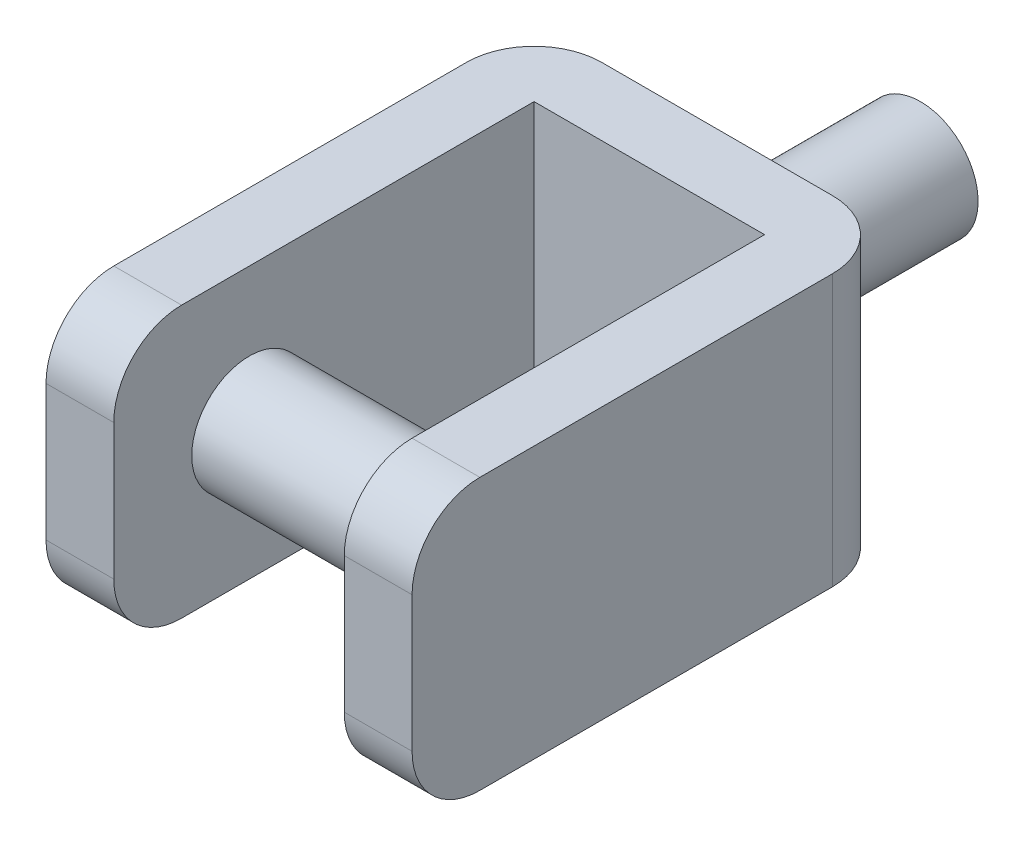
ISO-10303-21;
HEADER;
FILE_DESCRIPTION(('STEP AP214'),'2;1');
FILE_NAME('part.step','',(''),(''),'','','');
FILE_SCHEMA(('AUTOMOTIVE_DESIGN { 1 0 10303 214 1 1 1 1 }'));
ENDSEC;
DATA;
#1=APPLICATION_CONTEXT('core data for automotive mechanical design processes');
#2=APPLICATION_PROTOCOL_DEFINITION('international standard','automotive_design',2000,#1);
#3=PRODUCT_CONTEXT('',#1,'mechanical');
#4=PRODUCT('Part','Part','',(#3));
#5=PRODUCT_RELATED_PRODUCT_CATEGORY('part','',(#4));
#6=PRODUCT_DEFINITION_FORMATION('','',#4);
#7=PRODUCT_DEFINITION_CONTEXT('part definition',#1,'design');
#8=PRODUCT_DEFINITION('design','',#6,#7);
#9=PRODUCT_DEFINITION_SHAPE('','',#8);
#10=(LENGTH_UNIT() NAMED_UNIT(*) SI_UNIT(.MILLI.,.METRE.));
#11=(NAMED_UNIT(*) PLANE_ANGLE_UNIT() SI_UNIT($,.RADIAN.));
#12=(NAMED_UNIT(*) SI_UNIT($,.STERADIAN.) SOLID_ANGLE_UNIT());
#13=UNCERTAINTY_MEASURE_WITH_UNIT(LENGTH_MEASURE(1.E-05),#10,'distance_accuracy_value','');
#14=(GEOMETRIC_REPRESENTATION_CONTEXT(3) GLOBAL_UNCERTAINTY_ASSIGNED_CONTEXT((#13)) GLOBAL_UNIT_ASSIGNED_CONTEXT((#10,
#11,#12)) REPRESENTATION_CONTEXT('',''));
#15=CARTESIAN_POINT('',(0.,0.,0.));
#16=DIRECTION('',(0.,0.,1.));
#17=DIRECTION('',(1.,0.,0.));
#18=AXIS2_PLACEMENT_3D('',#15,#16,#17);
#19=CARTESIAN_POINT('',(-37.1336611930486,101.6,-124.03328));
#20=DIRECTION('',(-1.,0.,0.));
#21=DIRECTION('',(0.,0.,1.));
#22=AXIS2_PLACEMENT_3D('',#19,#20,#21);
#23=PLANE('',#22);
#24=CARTESIAN_POINT('',(-37.1336611930486,50.8,-17.35328));
#25=DIRECTION('',(-1.,0.,0.));
#26=DIRECTION('',(0.,0.,1.));
#27=AXIS2_PLACEMENT_3D('',#24,#25,#26);
#28=CIRCLE('',#27,21.59);
#29=CARTESIAN_POINT('',(-37.1336611930486,50.8,4.23672000000003));
#30=VERTEX_POINT('',#29);
#31=EDGE_CURVE('E161',#30,#30,#28,.F.);
#32=ORIENTED_EDGE('',*,*,#31,.F.);
#33=EDGE_LOOP('',(#32));
#34=FACE_BOUND('',#33,.T.);
#35=DIRECTION('',(0.,0.,-1.));
#36=VECTOR('',#35,1.);
#37=CARTESIAN_POINT('',(-37.1336611930486,101.6,-124.03328));
#38=LINE('',#37,#36);
#39=CARTESIAN_POINT('',(-37.1336611930486,101.6,8.04672000000003));
#40=VERTEX_POINT('',#39);
#41=CARTESIAN_POINT('',(-37.1336611930486,101.6,-124.03328));
#42=VERTEX_POINT('',#41);
#43=EDGE_CURVE('E134',#40,#42,#38,.T.);
#44=ORIENTED_EDGE('',*,*,#43,.F.);
#45=CARTESIAN_POINT('',(-37.1336611930486,76.2,8.04672000000004));
#46=DIRECTION('',(-1.,0.,0.));
#47=DIRECTION('',(0.,0.,1.));
#48=AXIS2_PLACEMENT_3D('',#45,#46,#47);
#49=CIRCLE('',#48,25.4);
#50=CARTESIAN_POINT('',(-37.1336611930486,76.2,33.44672));
#51=VERTEX_POINT('',#50);
#52=EDGE_CURVE('E173',#40,#51,#49,.F.);
#53=ORIENTED_EDGE('',*,*,#52,.T.);
#54=DIRECTION('',(0.,-1.,0.));
#55=VECTOR('',#54,1.);
#56=CARTESIAN_POINT('',(-37.1336611930486,101.6,33.44672));
#57=LINE('',#56,#55);
#58=CARTESIAN_POINT('',(-37.1336611930486,25.4,33.44672));
#59=VERTEX_POINT('',#58);
#60=EDGE_CURVE('E238',#51,#59,#57,.T.);
#61=ORIENTED_EDGE('',*,*,#60,.T.);
#62=CARTESIAN_POINT('',(-37.1336611930486,25.4,8.04672000000004));
#63=DIRECTION('',(-1.,0.,0.));
#64=DIRECTION('',(0.,0.,1.));
#65=AXIS2_PLACEMENT_3D('',#62,#63,#64);
#66=CIRCLE('',#65,25.4);
#67=CARTESIAN_POINT('',(-37.1336611930486,0.,8.04672000000003));
#68=VERTEX_POINT('',#67);
#69=EDGE_CURVE('E171',#59,#68,#66,.F.);
#70=ORIENTED_EDGE('',*,*,#69,.T.);
#71=DIRECTION('',(0.,0.,-1.));
#72=VECTOR('',#71,1.);
#73=CARTESIAN_POINT('',(-37.1336611930486,0.,-124.03328));
#74=LINE('',#73,#72);
#75=CARTESIAN_POINT('',(-37.1336611930486,0.,-124.03328));
#76=VERTEX_POINT('',#75);
#77=EDGE_CURVE('E156',#68,#76,#74,.T.);
#78=ORIENTED_EDGE('',*,*,#77,.T.);
#79=DIRECTION('',(0.,-1.,0.));
#80=VECTOR('',#79,1.);
#81=CARTESIAN_POINT('',(-37.1336611930486,101.6,-124.03328));
#82=LINE('',#81,#80);
#83=EDGE_CURVE('E149',#42,#76,#82,.T.);
#84=ORIENTED_EDGE('',*,*,#83,.F.);
#85=EDGE_LOOP('',(#44,#53,#61,#70,#78,#84));
#86=FACE_BOUND('',#85,.T.);
#87=ADVANCED_FACE('F33',(#34,#86),#23,.F.);
#88=CARTESIAN_POINT('',(-37.1336611930486,101.6,-124.03328));
#89=DIRECTION('',(0.,0.,-1.));
#90=DIRECTION('',(-1.,0.,0.));
#91=AXIS2_PLACEMENT_3D('',#88,#89,#90);
#92=PLANE('',#91);
#93=DIRECTION('',(1.,0.,0.));
#94=VECTOR('',#93,1.);
#95=CARTESIAN_POINT('',(-37.1336611930486,0.,-124.03328));
#96=LINE('',#95,#94);
#97=CARTESIAN_POINT('',(49.2263388069514,0.,-124.03328));
#98=VERTEX_POINT('',#97);
#99=EDGE_CURVE('E264',#76,#98,#96,.T.);
#100=ORIENTED_EDGE('',*,*,#99,.T.);
#101=DIRECTION('',(0.,-1.,0.));
#102=VECTOR('',#101,1.);
#103=CARTESIAN_POINT('',(49.2263388069514,101.6,-124.03328));
#104=LINE('',#103,#102);
#105=CARTESIAN_POINT('',(49.2263388069514,101.6,-124.03328));
#106=VERTEX_POINT('',#105);
#107=EDGE_CURVE('E151',#106,#98,#104,.T.);
#108=ORIENTED_EDGE('',*,*,#107,.F.);
#109=DIRECTION('',(1.,0.,0.));
#110=VECTOR('',#109,1.);
#111=CARTESIAN_POINT('',(-37.1336611930486,101.6,-124.03328));
#112=LINE('',#111,#110);
#113=EDGE_CURVE('E138',#42,#106,#112,.T.);
#114=ORIENTED_EDGE('',*,*,#113,.F.);
#115=ORIENTED_EDGE('',*,*,#83,.T.);
#116=EDGE_LOOP('',(#100,#108,#114,#115));
#117=FACE_BOUND('',#116,.T.);
#118=ADVANCED_FACE('F148',(#117),#92,.F.);
#119=CARTESIAN_POINT('',(49.2263388069514,101.6,-124.03328));
#120=DIRECTION('',(1.,0.,0.));
#121=DIRECTION('',(0.,0.,-1.));
#122=AXIS2_PLACEMENT_3D('',#119,#120,#121);
#123=PLANE('',#122);
#124=CARTESIAN_POINT('',(49.2263388069514,50.8,-17.35328));
#125=DIRECTION('',(1.,0.,0.));
#126=DIRECTION('',(0.,0.,-1.));
#127=AXIS2_PLACEMENT_3D('',#124,#125,#126);
#128=CIRCLE('',#127,21.59);
#129=CARTESIAN_POINT('',(49.2263388069514,50.8,-38.94328));
#130=VERTEX_POINT('',#129);
#131=EDGE_CURVE('E158',#130,#130,#128,.F.);
#132=ORIENTED_EDGE('',*,*,#131,.F.);
#133=EDGE_LOOP('',(#132));
#134=FACE_BOUND('',#133,.T.);
#135=DIRECTION('',(0.,0.,1.));
#136=VECTOR('',#135,1.);
#137=CARTESIAN_POINT('',(49.2263388069514,0.,-124.03328));
#138=LINE('',#137,#136);
#139=CARTESIAN_POINT('',(49.2263388069514,0.,8.04672000000003));
#140=VERTEX_POINT('',#139);
#141=EDGE_CURVE('E234',#98,#140,#138,.T.);
#142=ORIENTED_EDGE('',*,*,#141,.T.);
#143=CARTESIAN_POINT('',(49.2263388069514,25.4,8.04672000000004));
#144=DIRECTION('',(1.,0.,0.));
#145=DIRECTION('',(0.,0.,-1.));
#146=AXIS2_PLACEMENT_3D('',#143,#144,#145);
#147=CIRCLE('',#146,25.4);
#148=CARTESIAN_POINT('',(49.2263388069514,25.4,33.44672));
#149=VERTEX_POINT('',#148);
#150=EDGE_CURVE('E212',#140,#149,#147,.F.);
#151=ORIENTED_EDGE('',*,*,#150,.T.);
#152=DIRECTION('',(0.,-1.,0.));
#153=VECTOR('',#152,1.);
#154=CARTESIAN_POINT('',(49.2263388069514,101.6,33.44672));
#155=LINE('',#154,#153);
#156=CARTESIAN_POINT('',(49.2263388069514,76.2,33.44672));
#157=VERTEX_POINT('',#156);
#158=EDGE_CURVE('E163',#157,#149,#155,.T.);
#159=ORIENTED_EDGE('',*,*,#158,.F.);
#160=CARTESIAN_POINT('',(49.2263388069514,76.2,8.04672000000004));
#161=DIRECTION('',(1.,0.,0.));
#162=DIRECTION('',(0.,0.,-1.));
#163=AXIS2_PLACEMENT_3D('',#160,#161,#162);
#164=CIRCLE('',#163,25.4);
#165=CARTESIAN_POINT('',(49.2263388069514,101.6,8.04672000000003));
#166=VERTEX_POINT('',#165);
#167=EDGE_CURVE('E210',#157,#166,#164,.F.);
#168=ORIENTED_EDGE('',*,*,#167,.T.);
#169=DIRECTION('',(0.,0.,1.));
#170=VECTOR('',#169,1.);
#171=CARTESIAN_POINT('',(49.2263388069514,101.6,-124.03328));
#172=LINE('',#171,#170);
#173=EDGE_CURVE('E153',#106,#166,#172,.T.);
#174=ORIENTED_EDGE('',*,*,#173,.F.);
#175=ORIENTED_EDGE('',*,*,#107,.T.);
#176=EDGE_LOOP('',(#142,#151,#159,#168,#174,#175));
#177=FACE_BOUND('',#176,.T.);
#178=ADVANCED_FACE('F263',(#134,#177),#123,.F.);
#179=CARTESIAN_POINT('',(74.6263388069514,101.6,33.44672));
#180=DIRECTION('',(0.,0.,-1.));
#181=DIRECTION('',(-1.,0.,0.));
#182=AXIS2_PLACEMENT_3D('',#179,#180,#181);
#183=PLANE('',#182);
#184=ORIENTED_EDGE('',*,*,#158,.T.);
#185=DIRECTION('',(1.,0.,0.));
#186=VECTOR('',#185,1.);
#187=CARTESIAN_POINT('',(74.6263388069514,25.4,33.44672));
#188=LINE('',#187,#186);
#189=CARTESIAN_POINT('',(74.6263388069514,25.4,33.44672));
#190=VERTEX_POINT('',#189);
#191=EDGE_CURVE('E201',#149,#190,#188,.T.);
#192=ORIENTED_EDGE('',*,*,#191,.T.);
#193=DIRECTION('',(0.,-1.,0.));
#194=VECTOR('',#193,1.);
#195=CARTESIAN_POINT('',(74.6263388069514,101.6,33.44672));
#196=LINE('',#195,#194);
#197=CARTESIAN_POINT('',(74.6263388069514,76.2,33.44672));
#198=VERTEX_POINT('',#197);
#199=EDGE_CURVE('E245',#198,#190,#196,.T.);
#200=ORIENTED_EDGE('',*,*,#199,.F.);
#201=DIRECTION('',(1.,0.,0.));
#202=VECTOR('',#201,1.);
#203=CARTESIAN_POINT('',(74.6263388069514,76.2,33.44672));
#204=LINE('',#203,#202);
#205=EDGE_CURVE('E199',#198,#157,#204,.F.);
#206=ORIENTED_EDGE('',*,*,#205,.T.);
#207=EDGE_LOOP('',(#184,#192,#200,#206));
#208=FACE_BOUND('',#207,.T.);
#209=ADVANCED_FACE('F251',(#208),#183,.F.);
#210=CARTESIAN_POINT('',(74.6263388069514,101.6,-149.43328));
#211=DIRECTION('',(-1.,0.,0.));
#212=DIRECTION('',(0.,0.,1.));
#213=AXIS2_PLACEMENT_3D('',#210,#211,#212);
#214=PLANE('',#213);
#215=DIRECTION('',(0.,0.,-1.));
#216=VECTOR('',#215,1.);
#217=CARTESIAN_POINT('',(74.6263388069514,0.,-149.43328));
#218=LINE('',#217,#216);
#219=CARTESIAN_POINT('',(74.6263388069514,0.,8.04671999999998));
#220=VERTEX_POINT('',#219);
#221=CARTESIAN_POINT('',(74.6263388069514,0.,-124.03328));
#222=VERTEX_POINT('',#221);
#223=EDGE_CURVE('E231',#220,#222,#218,.T.);
#224=ORIENTED_EDGE('',*,*,#223,.T.);
#225=DIRECTION('',(0.,-1.,0.));
#226=VECTOR('',#225,1.);
#227=CARTESIAN_POINT('',(74.6263388069514,101.6,-124.03328));
#228=LINE('',#227,#226);
#229=CARTESIAN_POINT('',(74.6263388069514,101.6,-124.03328));
#230=VERTEX_POINT('',#229);
#231=EDGE_CURVE('E41',#222,#230,#228,.F.);
#232=ORIENTED_EDGE('',*,*,#231,.T.);
#233=DIRECTION('',(0.,0.,-1.));
#234=VECTOR('',#233,1.);
#235=CARTESIAN_POINT('',(74.6263388069514,101.6,-149.43328));
#236=LINE('',#235,#234);
#237=CARTESIAN_POINT('',(74.6263388069514,101.6,8.04671999999998));
#238=VERTEX_POINT('',#237);
#239=EDGE_CURVE('E271',#238,#230,#236,.T.);
#240=ORIENTED_EDGE('',*,*,#239,.F.);
#241=CARTESIAN_POINT('',(74.6263388069514,76.2,8.04672000000004));
#242=DIRECTION('',(-1.,0.,0.));
#243=DIRECTION('',(0.,0.,1.));
#244=AXIS2_PLACEMENT_3D('',#241,#242,#243);
#245=CIRCLE('',#244,25.4);
#246=EDGE_CURVE('E204',#238,#198,#245,.F.);
#247=ORIENTED_EDGE('',*,*,#246,.T.);
#248=ORIENTED_EDGE('',*,*,#199,.T.);
#249=CARTESIAN_POINT('',(74.6263388069514,25.4,8.04672000000004));
#250=DIRECTION('',(-1.,0.,0.));
#251=DIRECTION('',(0.,0.,1.));
#252=AXIS2_PLACEMENT_3D('',#249,#250,#251);
#253=CIRCLE('',#252,25.4);
#254=EDGE_CURVE('E206',#190,#220,#253,.F.);
#255=ORIENTED_EDGE('',*,*,#254,.T.);
#256=EDGE_LOOP('',(#224,#232,#240,#247,#248,#255));
#257=FACE_BOUND('',#256,.T.);
#258=ADVANCED_FACE('F260',(#257),#214,.F.);
#259=CARTESIAN_POINT('',(-62.5336611930486,101.6,-149.43328));
#260=DIRECTION('',(0.,0.,1.));
#261=DIRECTION('',(1.,0.,0.));
#262=AXIS2_PLACEMENT_3D('',#259,#260,#261);
#263=PLANE('',#262);
#264=CARTESIAN_POINT('',(6.04633880695141,50.8,-149.43328));
#265=DIRECTION('',(0.,0.,-1.));
#266=DIRECTION('',(-1.,0.,0.));
#267=AXIS2_PLACEMENT_3D('',#264,#265,#266);
#268=CIRCLE('',#267,21.59);
#269=CARTESIAN_POINT('',(-15.5436611930486,50.8,-149.43328));
#270=VERTEX_POINT('',#269);
#271=EDGE_CURVE('E169',#270,#270,#268,.T.);
#272=ORIENTED_EDGE('',*,*,#271,.F.);
#273=EDGE_LOOP('',(#272));
#274=FACE_BOUND('',#273,.T.);
#275=DIRECTION('',(-1.,0.,0.));
#276=VECTOR('',#275,1.);
#277=CARTESIAN_POINT('',(-62.5336611930486,101.6,-149.43328));
#278=LINE('',#277,#276);
#279=CARTESIAN_POINT('',(49.2263388069514,101.6,-149.43328));
#280=VERTEX_POINT('',#279);
#281=CARTESIAN_POINT('',(-37.1336611930486,101.6,-149.43328));
#282=VERTEX_POINT('',#281);
#283=EDGE_CURVE('E225',#280,#282,#278,.T.);
#284=ORIENTED_EDGE('',*,*,#283,.F.);
#285=DIRECTION('',(0.,-1.,0.));
#286=VECTOR('',#285,1.);
#287=CARTESIAN_POINT('',(49.2263388069514,101.6,-149.43328));
#288=LINE('',#287,#286);
#289=CARTESIAN_POINT('',(49.2263388069514,0.,-149.43328));
#290=VERTEX_POINT('',#289);
#291=EDGE_CURVE('E217',#280,#290,#288,.T.);
#292=ORIENTED_EDGE('',*,*,#291,.T.);
#293=DIRECTION('',(-1.,0.,0.));
#294=VECTOR('',#293,1.);
#295=CARTESIAN_POINT('',(-62.5336611930486,0.,-149.43328));
#296=LINE('',#295,#294);
#297=CARTESIAN_POINT('',(-37.1336611930486,0.,-149.43328));
#298=VERTEX_POINT('',#297);
#299=EDGE_CURVE('E224',#290,#298,#296,.T.);
#300=ORIENTED_EDGE('',*,*,#299,.T.);
#301=DIRECTION('',(0.,-1.,0.));
#302=VECTOR('',#301,1.);
#303=CARTESIAN_POINT('',(-37.1336611930486,101.6,-149.43328));
#304=LINE('',#303,#302);
#305=EDGE_CURVE('E194',#298,#282,#304,.F.);
#306=ORIENTED_EDGE('',*,*,#305,.T.);
#307=EDGE_LOOP('',(#284,#292,#300,#306));
#308=FACE_BOUND('',#307,.T.);
#309=ADVANCED_FACE('F223',(#274,#308),#263,.F.);
#310=CARTESIAN_POINT('',(-62.5336611930486,101.6,33.44672));
#311=DIRECTION('',(1.,0.,0.));
#312=DIRECTION('',(0.,0.,-1.));
#313=AXIS2_PLACEMENT_3D('',#310,#311,#312);
#314=PLANE('',#313);
#315=DIRECTION('',(0.,0.,1.));
#316=VECTOR('',#315,1.);
#317=CARTESIAN_POINT('',(-62.5336611930486,101.6,33.44672));
#318=LINE('',#317,#316);
#319=CARTESIAN_POINT('',(-62.5336611930486,101.6,-124.03328));
#320=VERTEX_POINT('',#319);
#321=CARTESIAN_POINT('',(-62.5336611930486,101.6,8.04672000000005));
#322=VERTEX_POINT('',#321);
#323=EDGE_CURVE('E242',#320,#322,#318,.T.);
#324=ORIENTED_EDGE('',*,*,#323,.F.);
#325=DIRECTION('',(0.,-1.,0.));
#326=VECTOR('',#325,1.);
#327=CARTESIAN_POINT('',(-62.5336611930486,101.6,-124.03328));
#328=LINE('',#327,#326);
#329=CARTESIAN_POINT('',(-62.5336611930486,0.,-124.03328));
#330=VERTEX_POINT('',#329);
#331=EDGE_CURVE('E188',#320,#330,#328,.T.);
#332=ORIENTED_EDGE('',*,*,#331,.T.);
#333=DIRECTION('',(0.,0.,1.));
#334=VECTOR('',#333,1.);
#335=CARTESIAN_POINT('',(-62.5336611930486,0.,33.44672));
#336=LINE('',#335,#334);
#337=CARTESIAN_POINT('',(-62.5336611930486,0.,8.04672000000005));
#338=VERTEX_POINT('',#337);
#339=EDGE_CURVE('E144',#330,#338,#336,.T.);
#340=ORIENTED_EDGE('',*,*,#339,.T.);
#341=CARTESIAN_POINT('',(-62.5336611930486,25.4,8.04672000000004));
#342=DIRECTION('',(1.,0.,0.));
#343=DIRECTION('',(0.,0.,-1.));
#344=AXIS2_PLACEMENT_3D('',#341,#342,#343);
#345=CIRCLE('',#344,25.4);
#346=CARTESIAN_POINT('',(-62.5336611930486,25.4,33.44672));
#347=VERTEX_POINT('',#346);
#348=EDGE_CURVE('E180',#338,#347,#345,.F.);
#349=ORIENTED_EDGE('',*,*,#348,.T.);
#350=DIRECTION('',(0.,-1.,0.));
#351=VECTOR('',#350,1.);
#352=CARTESIAN_POINT('',(-62.5336611930486,101.6,33.44672));
#353=LINE('',#352,#351);
#354=CARTESIAN_POINT('',(-62.5336611930486,76.2,33.44672));
#355=VERTEX_POINT('',#354);
#356=EDGE_CURVE('E241',#355,#347,#353,.T.);
#357=ORIENTED_EDGE('',*,*,#356,.F.);
#358=CARTESIAN_POINT('',(-62.5336611930486,76.2,8.04672000000004));
#359=DIRECTION('',(1.,0.,0.));
#360=DIRECTION('',(0.,0.,-1.));
#361=AXIS2_PLACEMENT_3D('',#358,#359,#360);
#362=CIRCLE('',#361,25.4);
#363=EDGE_CURVE('E182',#355,#322,#362,.F.);
#364=ORIENTED_EDGE('',*,*,#363,.T.);
#365=EDGE_LOOP('',(#324,#332,#340,#349,#357,#364));
#366=FACE_BOUND('',#365,.T.);
#367=ADVANCED_FACE('F289',(#366),#314,.F.);
#368=CARTESIAN_POINT('',(-37.1336611930486,101.6,33.44672));
#369=DIRECTION('',(0.,0.,-1.));
#370=DIRECTION('',(-1.,0.,0.));
#371=AXIS2_PLACEMENT_3D('',#368,#369,#370);
#372=PLANE('',#371);
#373=ORIENTED_EDGE('',*,*,#60,.F.);
#374=DIRECTION('',(1.,0.,0.));
#375=VECTOR('',#374,1.);
#376=CARTESIAN_POINT('',(-37.1336611930486,76.2,33.44672));
#377=LINE('',#376,#375);
#378=EDGE_CURVE('E178',#51,#355,#377,.F.);
#379=ORIENTED_EDGE('',*,*,#378,.T.);
#380=ORIENTED_EDGE('',*,*,#356,.T.);
#381=DIRECTION('',(1.,0.,0.));
#382=VECTOR('',#381,1.);
#383=CARTESIAN_POINT('',(-37.1336611930486,25.4,33.44672));
#384=LINE('',#383,#382);
#385=EDGE_CURVE('E175',#347,#59,#384,.T.);
#386=ORIENTED_EDGE('',*,*,#385,.T.);
#387=EDGE_LOOP('',(#373,#379,#380,#386));
#388=FACE_BOUND('',#387,.T.);
#389=ADVANCED_FACE('F296',(#388),#372,.F.);
#390=CARTESIAN_POINT('',(0.,101.6,0.));
#391=DIRECTION('',(0.,-1.,0.));
#392=DIRECTION('',(0.,0.,-1.));
#393=AXIS2_PLACEMENT_3D('',#390,#391,#392);
#394=PLANE('',#393);
#395=ORIENTED_EDGE('',*,*,#239,.T.);
#396=CARTESIAN_POINT('',(49.2263388069514,101.6,-124.03328));
#397=DIRECTION('',(0.,-1.,0.));
#398=DIRECTION('',(0.,0.,-1.));
#399=AXIS2_PLACEMENT_3D('',#396,#397,#398);
#400=CIRCLE('',#399,25.4);
#401=EDGE_CURVE('E11',#230,#280,#400,.F.);
#402=ORIENTED_EDGE('',*,*,#401,.T.);
#403=ORIENTED_EDGE('',*,*,#283,.T.);
#404=CARTESIAN_POINT('',(-37.1336611930486,101.6,-124.03328));
#405=DIRECTION('',(0.,-1.,0.));
#406=DIRECTION('',(0.,0.,-1.));
#407=AXIS2_PLACEMENT_3D('',#404,#405,#406);
#408=CIRCLE('',#407,25.4);
#409=EDGE_CURVE('E197',#282,#320,#408,.F.);
#410=ORIENTED_EDGE('',*,*,#409,.T.);
#411=ORIENTED_EDGE('',*,*,#323,.T.);
#412=DIRECTION('',(1.,0.,0.));
#413=VECTOR('',#412,1.);
#414=CARTESIAN_POINT('',(0.,101.6,8.04672000000004));
#415=LINE('',#414,#413);
#416=EDGE_CURVE('E141',#322,#40,#415,.T.);
#417=ORIENTED_EDGE('',*,*,#416,.T.);
#418=ORIENTED_EDGE('',*,*,#43,.T.);
#419=ORIENTED_EDGE('',*,*,#113,.T.);
#420=ORIENTED_EDGE('',*,*,#173,.T.);
#421=DIRECTION('',(1.,0.,0.));
#422=VECTOR('',#421,1.);
#423=CARTESIAN_POINT('',(0.,101.6,8.04672000000004));
#424=LINE('',#423,#422);
#425=EDGE_CURVE('E214',#166,#238,#424,.T.);
#426=ORIENTED_EDGE('',*,*,#425,.T.);
#427=EDGE_LOOP('',(#395,#402,#403,#410,#411,#417,#418,#419,#420,#426));
#428=FACE_BOUND('',#427,.T.);
#429=ADVANCED_FACE('F136',(#428),#394,.F.);
#430=CARTESIAN_POINT('',(0.,0.,0.));
#431=DIRECTION('',(0.,-1.,0.));
#432=DIRECTION('',(0.,0.,-1.));
#433=AXIS2_PLACEMENT_3D('',#430,#431,#432);
#434=PLANE('',#433);
#435=ORIENTED_EDGE('',*,*,#299,.F.);
#436=CARTESIAN_POINT('',(49.2263388069514,0.,-124.03328));
#437=DIRECTION('',(0.,-1.,0.));
#438=DIRECTION('',(0.,0.,-1.));
#439=AXIS2_PLACEMENT_3D('',#436,#437,#438);
#440=CIRCLE('',#439,25.4);
#441=EDGE_CURVE('E55',#290,#222,#440,.T.);
#442=ORIENTED_EDGE('',*,*,#441,.T.);
#443=ORIENTED_EDGE('',*,*,#223,.F.);
#444=DIRECTION('',(1.,0.,0.));
#445=VECTOR('',#444,1.);
#446=CARTESIAN_POINT('',(49.2263388069514,0.,8.04672000000004));
#447=LINE('',#446,#445);
#448=EDGE_CURVE('E208',#220,#140,#447,.F.);
#449=ORIENTED_EDGE('',*,*,#448,.T.);
#450=ORIENTED_EDGE('',*,*,#141,.F.);
#451=ORIENTED_EDGE('',*,*,#99,.F.);
#452=ORIENTED_EDGE('',*,*,#77,.F.);
#453=DIRECTION('',(1.,0.,0.));
#454=VECTOR('',#453,1.);
#455=CARTESIAN_POINT('',(-62.5336611930486,0.,8.04672000000004));
#456=LINE('',#455,#454);
#457=EDGE_CURVE('E185',#68,#338,#456,.F.);
#458=ORIENTED_EDGE('',*,*,#457,.T.);
#459=ORIENTED_EDGE('',*,*,#339,.F.);
#460=CARTESIAN_POINT('',(-37.1336611930486,0.,-124.03328));
#461=DIRECTION('',(0.,-1.,0.));
#462=DIRECTION('',(0.,0.,-1.));
#463=AXIS2_PLACEMENT_3D('',#460,#461,#462);
#464=CIRCLE('',#463,25.4);
#465=EDGE_CURVE('E191',#330,#298,#464,.T.);
#466=ORIENTED_EDGE('',*,*,#465,.T.);
#467=EDGE_LOOP('',(#435,#442,#443,#449,#450,#451,#452,#458,#459,#466));
#468=FACE_BOUND('',#467,.T.);
#469=ADVANCED_FACE('F228',(#468),#434,.T.);
#470=CARTESIAN_POINT('',(74.6283388069514,50.8,-17.35328));
#471=DIRECTION('',(-1.,0.,0.));
#472=DIRECTION('',(0.,0.,1.));
#473=AXIS2_PLACEMENT_3D('',#470,#471,#472);
#474=CYLINDRICAL_SURFACE('',#473,21.59);
#475=ORIENTED_EDGE('',*,*,#31,.T.);
#476=EDGE_LOOP('',(#475));
#477=FACE_BOUND('',#476,.T.);
#478=ORIENTED_EDGE('',*,*,#131,.T.);
#479=EDGE_LOOP('',(#478));
#480=FACE_BOUND('',#479,.T.);
#481=ADVANCED_FACE('F284',(#477,#480),#474,.T.);
#482=CARTESIAN_POINT('',(6.04633880695141,50.8,-225.63328));
#483=DIRECTION('',(0.,0.,1.));
#484=DIRECTION('',(1.,0.,0.));
#485=AXIS2_PLACEMENT_3D('',#482,#483,#484);
#486=CYLINDRICAL_SURFACE('',#485,21.59);
#487=CARTESIAN_POINT('',(6.04633880695141,50.8,-225.63328));
#488=DIRECTION('',(0.,0.,-1.));
#489=DIRECTION('',(-1.,0.,0.));
#490=AXIS2_PLACEMENT_3D('',#487,#488,#489);
#491=CIRCLE('',#490,21.59);
#492=CARTESIAN_POINT('',(-15.5436611930486,50.8,-225.63328));
#493=VERTEX_POINT('',#492);
#494=EDGE_CURVE('E268',#493,#493,#491,.T.);
#495=ORIENTED_EDGE('',*,*,#494,.F.);
#496=EDGE_LOOP('',(#495));
#497=FACE_BOUND('',#496,.T.);
#498=ORIENTED_EDGE('',*,*,#271,.T.);
#499=EDGE_LOOP('',(#498));
#500=FACE_BOUND('',#499,.T.);
#501=ADVANCED_FACE('F281',(#497,#500),#486,.T.);
#502=CARTESIAN_POINT('',(6.04633880695141,50.8,-225.63328));
#503=DIRECTION('',(0.,0.,-1.));
#504=DIRECTION('',(-1.,0.,0.));
#505=AXIS2_PLACEMENT_3D('',#502,#503,#504);
#506=PLANE('',#505);
#507=ORIENTED_EDGE('',*,*,#494,.T.);
#508=EDGE_LOOP('',(#507));
#509=FACE_BOUND('',#508,.T.);
#510=ADVANCED_FACE('F279',(#509),#506,.T.);
#511=CARTESIAN_POINT('',(0.,76.2,8.04672000000004));
#512=DIRECTION('',(1.,0.,0.));
#513=DIRECTION('',(0.,0.,-1.));
#514=AXIS2_PLACEMENT_3D('',#511,#512,#513);
#515=CYLINDRICAL_SURFACE('',#514,25.4);
#516=ORIENTED_EDGE('',*,*,#363,.F.);
#517=ORIENTED_EDGE('',*,*,#378,.F.);
#518=ORIENTED_EDGE('',*,*,#52,.F.);
#519=ORIENTED_EDGE('',*,*,#416,.F.);
#520=EDGE_LOOP('',(#516,#517,#518,#519));
#521=FACE_BOUND('',#520,.T.);
#522=ADVANCED_FACE('F312',(#521),#515,.T.);
#523=CARTESIAN_POINT('',(-37.1336611930486,25.4,8.04672000000004));
#524=DIRECTION('',(-1.,0.,0.));
#525=DIRECTION('',(0.,0.,1.));
#526=AXIS2_PLACEMENT_3D('',#523,#524,#525);
#527=CYLINDRICAL_SURFACE('',#526,25.4);
#528=ORIENTED_EDGE('',*,*,#348,.F.);
#529=ORIENTED_EDGE('',*,*,#457,.F.);
#530=ORIENTED_EDGE('',*,*,#69,.F.);
#531=ORIENTED_EDGE('',*,*,#385,.F.);
#532=EDGE_LOOP('',(#528,#529,#530,#531));
#533=FACE_BOUND('',#532,.T.);
#534=ADVANCED_FACE('F315',(#533),#527,.T.);
#535=CARTESIAN_POINT('',(-37.1336611930486,101.6,-124.03328));
#536=DIRECTION('',(0.,-1.,0.));
#537=DIRECTION('',(0.,0.,-1.));
#538=AXIS2_PLACEMENT_3D('',#535,#536,#537);
#539=CYLINDRICAL_SURFACE('',#538,25.4);
#540=ORIENTED_EDGE('',*,*,#409,.F.);
#541=ORIENTED_EDGE('',*,*,#305,.F.);
#542=ORIENTED_EDGE('',*,*,#465,.F.);
#543=ORIENTED_EDGE('',*,*,#331,.F.);
#544=EDGE_LOOP('',(#540,#541,#542,#543));
#545=FACE_BOUND('',#544,.T.);
#546=ADVANCED_FACE('F319',(#545),#539,.T.);
#547=CARTESIAN_POINT('',(74.6263388069514,25.4,8.04672000000004));
#548=DIRECTION('',(-1.,0.,0.));
#549=DIRECTION('',(0.,0.,1.));
#550=AXIS2_PLACEMENT_3D('',#547,#548,#549);
#551=CYLINDRICAL_SURFACE('',#550,25.4);
#552=ORIENTED_EDGE('',*,*,#150,.F.);
#553=ORIENTED_EDGE('',*,*,#448,.F.);
#554=ORIENTED_EDGE('',*,*,#254,.F.);
#555=ORIENTED_EDGE('',*,*,#191,.F.);
#556=EDGE_LOOP('',(#552,#553,#554,#555));
#557=FACE_BOUND('',#556,.T.);
#558=ADVANCED_FACE('F258',(#557),#551,.T.);
#559=CARTESIAN_POINT('',(0.,76.2,8.04672000000004));
#560=DIRECTION('',(1.,0.,0.));
#561=DIRECTION('',(0.,0.,-1.));
#562=AXIS2_PLACEMENT_3D('',#559,#560,#561);
#563=CYLINDRICAL_SURFACE('',#562,25.4);
#564=ORIENTED_EDGE('',*,*,#167,.F.);
#565=ORIENTED_EDGE('',*,*,#205,.F.);
#566=ORIENTED_EDGE('',*,*,#246,.F.);
#567=ORIENTED_EDGE('',*,*,#425,.F.);
#568=EDGE_LOOP('',(#564,#565,#566,#567));
#569=FACE_BOUND('',#568,.T.);
#570=ADVANCED_FACE('F325',(#569),#563,.T.);
#571=CARTESIAN_POINT('',(49.2263388069514,101.6,-124.03328));
#572=DIRECTION('',(0.,-1.,0.));
#573=DIRECTION('',(0.,0.,-1.));
#574=AXIS2_PLACEMENT_3D('',#571,#572,#573);
#575=CYLINDRICAL_SURFACE('',#574,25.4);
#576=ORIENTED_EDGE('',*,*,#401,.F.);
#577=ORIENTED_EDGE('',*,*,#231,.F.);
#578=ORIENTED_EDGE('',*,*,#441,.F.);
#579=ORIENTED_EDGE('',*,*,#291,.F.);
#580=EDGE_LOOP('',(#576,#577,#578,#579));
#581=FACE_BOUND('',#580,.T.);
#582=ADVANCED_FACE('F35',(#581),#575,.T.);
#583=CLOSED_SHELL('',(#87,#118,#178,#209,#258,#309,#367,#389,#429,#469,#481,#501,#510,#522,#534,
#546,#558,#570,#582));
#584=MANIFOLD_SOLID_BREP('B2',#583);
#585=ADVANCED_BREP_SHAPE_REPRESENTATION('',(#18,#584),#14);
#586=SHAPE_DEFINITION_REPRESENTATION(#9,#585);
ENDSEC;
END-ISO-10303-21;
